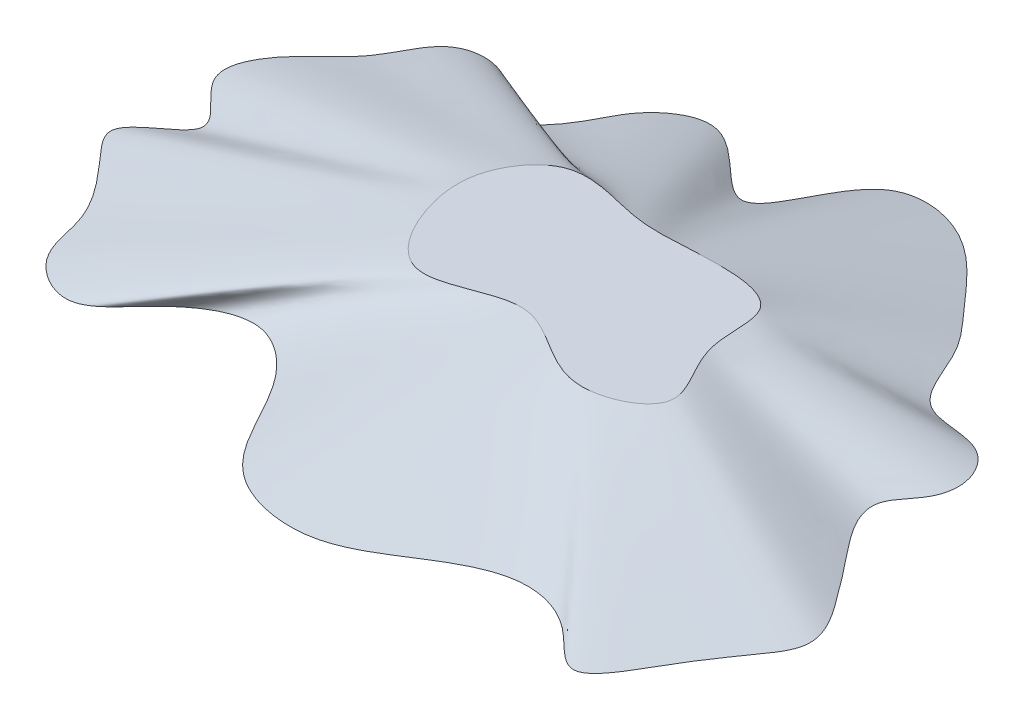
ISO-10303-21;
HEADER;
FILE_DESCRIPTION(('STEP AP214'),'2;1');
FILE_NAME('part.step','',(''),(''),'','','');
FILE_SCHEMA(('AUTOMOTIVE_DESIGN { 1 0 10303 214 1 1 1 1 }'));
ENDSEC;
DATA;
#1=APPLICATION_CONTEXT('core data for automotive mechanical design processes');
#2=APPLICATION_PROTOCOL_DEFINITION('international standard','automotive_design',2000,#1);
#3=PRODUCT_CONTEXT('',#1,'mechanical');
#4=PRODUCT('Part','Part','',(#3));
#5=PRODUCT_RELATED_PRODUCT_CATEGORY('part','',(#4));
#6=PRODUCT_DEFINITION_FORMATION('','',#4);
#7=PRODUCT_DEFINITION_CONTEXT('part definition',#1,'design');
#8=PRODUCT_DEFINITION('design','',#6,#7);
#9=PRODUCT_DEFINITION_SHAPE('','',#8);
#10=(LENGTH_UNIT() NAMED_UNIT(*) SI_UNIT(.MILLI.,.METRE.));
#11=(NAMED_UNIT(*) PLANE_ANGLE_UNIT() SI_UNIT($,.RADIAN.));
#12=(NAMED_UNIT(*) SI_UNIT($,.STERADIAN.) SOLID_ANGLE_UNIT());
#13=UNCERTAINTY_MEASURE_WITH_UNIT(LENGTH_MEASURE(1.E-05),#10,'distance_accuracy_value','');
#14=(GEOMETRIC_REPRESENTATION_CONTEXT(3) GLOBAL_UNCERTAINTY_ASSIGNED_CONTEXT((#13)) GLOBAL_UNIT_ASSIGNED_CONTEXT((#10,
#11,#12)) REPRESENTATION_CONTEXT('',''));
#15=CARTESIAN_POINT('',(0.,0.,0.));
#16=DIRECTION('',(0.,0.,1.));
#17=DIRECTION('',(1.,0.,0.));
#18=AXIS2_PLACEMENT_3D('',#15,#16,#17);
#19=CARTESIAN_POINT('',(34.9083848394784,12.7,4.71063547577298));
#20=DIRECTION('',(0.,1.,0.));
#21=DIRECTION('',(0.,0.,1.));
#22=AXIS2_PLACEMENT_3D('',#19,#20,#21);
#23=PLANE('',#22);
#24=CARTESIAN_POINT('',(-29.5756730277102,12.7,3.52827025257535));
#25=CARTESIAN_POINT('',(-27.8814864728783,12.7,10.6717173190112));
#26=CARTESIAN_POINT('',(-19.0901605450378,12.7,26.9384464948508));
#27=CARTESIAN_POINT('',(5.50930371801553,12.7,8.15901188641278));
#28=CARTESIAN_POINT('',(20.7413398009985,12.7,29.8795978044202));
#29=CARTESIAN_POINT('',(45.5831379688821,12.7,17.9785133429483));
#30=CARTESIAN_POINT('',(30.8297716786299,12.7,3.11660304964641));
#31=CARTESIAN_POINT('',(35.1676287758205,12.7,-16.5945431904634));
#32=CARTESIAN_POINT('',(13.2930390906351,12.7,-17.2081131785827));
#33=CARTESIAN_POINT('',(-2.47161777381469,12.7,-15.1697993395968));
#34=CARTESIAN_POINT('',(-20.2384691081271,12.7,-22.6843139276812));
#35=CARTESIAN_POINT('',(-30.712637420945,12.7,-8.98673720286616));
#36=CARTESIAN_POINT('',(-30.6206439788035,12.7,-0.877793916572667));
#37=CARTESIAN_POINT('',(-29.5756730277102,12.7,3.52827025257535));
#38=B_SPLINE_CURVE_WITH_KNOTS('',3,(#24,#25,#26,#27,#28,#29,#30,#31,#32,#33,#34,#35,#36,#37),
.UNSPECIFIED.,.T.,.F.,(4,1,1,1,1,1,1,1,1,1,1,4),(0.,0.106147136055088,0.216054178461619,
0.347828588984127,0.426500589345041,0.514470445120685,0.592300723714563,0.684574484635472,
0.770463698091376,0.869982034654855,0.934528654236482,1.),.UNSPECIFIED.);
#39=CARTESIAN_POINT('',(-29.5756730277102,12.7,3.52827025257535));
#40=VERTEX_POINT('',#39);
#41=EDGE_CURVE('E55',#40,#40,#38,.T.);
#42=ORIENTED_EDGE('',*,*,#41,.T.);
#43=EDGE_LOOP('',(#42));
#44=FACE_BOUND('',#43,.T.);
#45=ADVANCED_FACE('F45',(#44),#23,.T.);
#46=CARTESIAN_POINT('',(73.5532406350785,0.,5.61808507576661));
#47=DIRECTION('',(0.,1.,0.));
#48=DIRECTION('',(0.,0.,1.));
#49=AXIS2_PLACEMENT_3D('',#46,#47,#48);
#50=PLANE('',#49);
#51=CARTESIAN_POINT('',(-95.2284648689735,0.,15.2013776373955));
#52=CARTESIAN_POINT('',(-95.2999292131674,0.,17.140655024939));
#53=CARTESIAN_POINT('',(-88.1114495701708,0.,25.351341490162));
#54=CARTESIAN_POINT('',(-79.9806306202945,0.,34.4559803815624));
#55=CARTESIAN_POINT('',(-78.5772801666937,0.,49.9621990224749));
#56=CARTESIAN_POINT('',(-63.932190207539,0.,58.8519478013123));
#57=CARTESIAN_POINT('',(-53.6062240830265,0.,44.3096662119803));
#58=CARTESIAN_POINT('',(-39.4292443910359,0.,34.8010942162573));
#59=CARTESIAN_POINT('',(-19.9603510233611,0.,47.4882191715443));
#60=CARTESIAN_POINT('',(-15.4584015850629,0.,72.3025830851409));
#61=CARTESIAN_POINT('',(12.7202670566613,0.,77.7518749276973));
#62=CARTESIAN_POINT('',(28.8247185416495,0.,67.1435866749527));
#63=CARTESIAN_POINT('',(44.6671187849523,0.,57.3981227184752));
#64=CARTESIAN_POINT('',(60.6026243534746,0.,61.3259804845011));
#65=CARTESIAN_POINT('',(70.9518830490098,0.,75.2011435785986));
#66=CARTESIAN_POINT('',(78.8518561387934,0.,63.3871054523166));
#67=CARTESIAN_POINT('',(83.3757118431352,0.,54.9365343862368));
#68=CARTESIAN_POINT('',(89.2013718906085,0.,46.8808231523344));
#69=CARTESIAN_POINT('',(95.9252003762561,0.,37.123302953244));
#70=CARTESIAN_POINT('',(87.8909866986869,0.,25.3215617032036));
#71=CARTESIAN_POINT('',(79.9617244020685,0.,15.2216194290523));
#72=CARTESIAN_POINT('',(69.1856356253337,0.,1.85083623637777));
#73=CARTESIAN_POINT('',(78.3048921111515,0.,-6.21852794537924));
#74=CARTESIAN_POINT('',(79.8571996099118,0.,-14.7231176542555));
#75=CARTESIAN_POINT('',(73.5811822429659,0.,-24.9196258588382));
#76=CARTESIAN_POINT('',(56.5276304884445,0.,-21.8915130727115));
#77=CARTESIAN_POINT('',(52.6041220557884,0.,-39.3745976726916));
#78=CARTESIAN_POINT('',(40.3187225768359,0.,-52.2197178312823));
#79=CARTESIAN_POINT('',(29.0701179535843,0.,-66.7128898911529));
#80=CARTESIAN_POINT('',(3.96459095788384,0.,-68.5496640165683));
#81=CARTESIAN_POINT('',(-3.07255429867468,0.,-33.026131759314));
#82=CARTESIAN_POINT('',(-21.2896083413009,0.,-63.4514265533331));
#83=CARTESIAN_POINT('',(-37.2022843766891,0.,-51.9408378208401));
#84=CARTESIAN_POINT('',(-40.7331558658021,0.,-42.1777722488928));
#85=CARTESIAN_POINT('',(-50.6258679729517,0.,-30.2542898370378));
#86=CARTESIAN_POINT('',(-58.3453073919591,0.,-45.2313873466331));
#87=CARTESIAN_POINT('',(-74.0783248517851,0.,-44.6344404860311));
#88=CARTESIAN_POINT('',(-79.00242846214,0.,-29.1717805608579));
#89=CARTESIAN_POINT('',(-90.6339799739566,0.,-22.051772230378));
#90=CARTESIAN_POINT('',(-97.6884917412061,0.,-6.54196325179716));
#91=CARTESIAN_POINT('',(-76.6790199345395,0.,4.08239423804333));
#92=CARTESIAN_POINT('',(-95.0736064689189,0.,10.9990947103683));
#93=CARTESIAN_POINT('',(-95.2284648689735,0.,15.2013776373955));
#94=B_SPLINE_CURVE_WITH_KNOTS('',3,(#51,#52,#53,#54,#55,#56,#57,#58,#59,#60,#61,#62,#63,#64,#65,
#66,#67,#68,#69,#70,#71,#72,#73,#74,#75,#76,#77,#78,#79,#80,#81,#82,#83,#84,#85,#86,#87,#88,#89,
#90,#91,#92,#93),.UNSPECIFIED.,.T.,.F.,(4,1,1,1,1,1,1,1,1,1,1,1,1,1,1,1,1,1,1,1,1,1,1,1,1,1,1,1,
1,1,1,1,1,1,1,1,1,1,1,1,4),(0.,0.0119231063799372,0.0465572653297819,0.0655553056181603,
0.0882298451152997,0.112693562398542,0.145128486102264,0.163385092650192,0.220901848117804,
0.257258383958837,0.287774358610111,0.318884962902541,0.347533475958289,0.367888519124409,
0.384580206138698,0.403052400023825,0.421263560654512,0.43565674970862,0.458928458882621,
0.482188295744393,0.510618234724564,0.524722254432494,0.536927739099029,0.55275879313431,
0.577529207122736,0.606822873222294,0.626996171293105,0.670842276135462,0.695764623177421,
0.737654051371631,0.775272657919951,0.798698159610183,0.816582819180089,0.834508616606692,
0.85716690777534,0.876906519246642,0.900601670257543,0.929756712078599,0.947972927854597,
0.974163434947794,1.),.UNSPECIFIED.);
#95=CARTESIAN_POINT('',(-95.2284648689735,0.,15.2013776373955));
#96=VERTEX_POINT('',#95);
#97=EDGE_CURVE('E11',#96,#96,#94,.T.);
#98=ORIENTED_EDGE('',*,*,#97,.F.);
#99=EDGE_LOOP('',(#98));
#100=FACE_BOUND('',#99,.T.);
#101=ADVANCED_FACE('F102',(#100),#50,.F.);
#102=CARTESIAN_POINT('',(-95.2284648689736,0.,15.2013776373955));
#103=CARTESIAN_POINT('',(-29.5756730277102,12.7,3.52827025257534));
#104=CARTESIAN_POINT('',(-95.2999292131675,0.,17.140655024939));
#105=CARTESIAN_POINT('',(-29.3853714588555,12.7,4.33066664740941));
#106=CARTESIAN_POINT('',(-88.1114495701708,0.,25.351341490162));
#107=CARTESIAN_POINT('',(-28.5129570160902,12.7,7.5056560079508));
#108=CARTESIAN_POINT('',(-79.9806306202945,0.,34.4559803815624));
#109=CARTESIAN_POINT('',(-26.6057053369926,12.7,11.975080553669));
#110=CARTESIAN_POINT('',(-78.5772801666937,0.,49.9621990224749));
#111=CARTESIAN_POINT('',(-23.600881533361,12.7,16.2764230636256));
#112=CARTESIAN_POINT('',(-65.3818178244463,0.,57.972006102551));
#113=CARTESIAN_POINT('',(-20.81991592188,12.7,18.7892704347481));
#114=CARTESIAN_POINT('',(-58.6647136095989,0.,51.4336464986749));
#115=CARTESIAN_POINT('',(-18.3237212544386,12.7,19.8496867670633));
#116=CARTESIAN_POINT('',(-50.2263793200784,0.,42.0427872320368));
#117=CARTESIAN_POINT('',(-15.117179780628,12.7,20.2967677545488));
#118=CARTESIAN_POINT('',(-39.4292443910359,0.,34.8010942162573));
#119=CARTESIAN_POINT('',(-11.6125841418971,12.7,19.5579171634531));
#120=CARTESIAN_POINT('',(-20.8325463731965,0.,46.9198431894171));
#121=CARTESIAN_POINT('',(-4.99216434644447,12.7,17.1369764265642));
#122=CARTESIAN_POINT('',(-17.1127261973175,0.,63.1840859713165));
#123=CARTESIAN_POINT('',(-0.0491436526245878,12.7,15.2315707923849));
#124=CARTESIAN_POINT('',(-3.52694829373998,0.,74.6099302461056));
#125=CARTESIAN_POINT('',(5.55686358530825,12.7,15.5919273126751));
#126=CARTESIAN_POINT('',(12.7202670566613,0.,77.7518749276973));
#127=CARTESIAN_POINT('',(9.58539989750889,12.7,17.2460544559311));
#128=CARTESIAN_POINT('',(28.8247185416495,0.,67.1435866749527));
#129=CARTESIAN_POINT('',(15.0048211724672,12.7,20.7270310121599));
#130=CARTESIAN_POINT('',(44.6671187849523,0.,57.3981227184752));
#131=CARTESIAN_POINT('',(20.268413494565,12.7,23.6625050943743));
#132=CARTESIAN_POINT('',(56.6125041749379,0.,60.3424770453883));
#133=CARTESIAN_POINT('',(24.1694073042659,12.7,24.57952755404));
#134=CARTESIAN_POINT('',(65.1622402274639,0.,67.4390186990479));
#135=CARTESIAN_POINT('',(27.5923216675784,12.7,24.6052864188884));
#136=CARTESIAN_POINT('',(70.9938756668749,0.,75.1383455939926));
#137=CARTESIAN_POINT('',(30.3079631645982,12.7,24.2389029893652));
#138=CARTESIAN_POINT('',(78.8518561387934,0.,63.3871054523166));
#139=CARTESIAN_POINT('',(34.1666063306382,12.7,22.8541107648814));
#140=CARTESIAN_POINT('',(83.3757118431352,0.,54.9365343862368));
#141=CARTESIAN_POINT('',(37.3102036395799,12.7,20.8939210196097));
#142=CARTESIAN_POINT('',(88.1570436355976,0.,48.3249182054643));
#143=CARTESIAN_POINT('',(38.9267652190391,12.7,18.9844234051192));
#144=CARTESIAN_POINT('',(92.0230025946149,0.,42.786114513129));
#145=CARTESIAN_POINT('',(39.5777898520955,12.7,17.3836871045497));
#146=CARTESIAN_POINT('',(95.2345874835911,0.,36.1088371958882));
#147=CARTESIAN_POINT('',(39.8627239500113,12.7,15.4664716048353));
#148=CARTESIAN_POINT('',(87.8909866986869,0.,25.3215617032036));
#149=CARTESIAN_POINT('',(38.9773617328739,12.7,12.4111727360836));
#150=CARTESIAN_POINT('',(79.9617244020685,0.,15.2216194290523));
#151=CARTESIAN_POINT('',(36.4862431488415,12.7,7.90119636665085));
#152=CARTESIAN_POINT('',(70.8647363116966,0.,3.93423511153363));
#153=CARTESIAN_POINT('',(34.5783862666323,12.7,4.25652323142171));
#154=CARTESIAN_POINT('',(74.5636442793247,0.,-2.90800681943336));
#155=CARTESIAN_POINT('',(33.6765379079749,12.7,1.33446853933737));
#156=CARTESIAN_POINT('',(78.4467937686131,0.,-6.99596113866357));
#157=CARTESIAN_POINT('',(33.2913772806231,12.7,-0.507859420364786));
#158=CARTESIAN_POINT('',(79.8571996099118,0.,-14.7231176542555));
#159=CARTESIAN_POINT('',(33.0101977346614,12.7,-3.20993316291858));
#160=CARTESIAN_POINT('',(73.5811822429659,0.,-24.9196258588382));
#161=CARTESIAN_POINT('',(32.8557652078619,12.7,-6.84983462375573));
#162=CARTESIAN_POINT('',(60.0708560838091,0.,-22.5206656905297));
#163=CARTESIAN_POINT('',(32.5604901643822,12.7,-10.2929623528028));
#164=CARTESIAN_POINT('',(54.4378059024621,0.,-31.2037346883828));
#165=CARTESIAN_POINT('',(31.4197736797052,12.7,-12.9395398771232));
#166=CARTESIAN_POINT('',(50.6593357127756,0.,-41.4079881457962));
#167=CARTESIAN_POINT('',(29.5049421524677,12.7,-14.7308523514768));
#168=CARTESIAN_POINT('',(40.3187225768359,0.,-52.2197178312823));
#169=CARTESIAN_POINT('',(25.1533397868337,12.7,-16.5529423958884));
#170=CARTESIAN_POINT('',(30.485352578508,0.,-64.8894424849113));
#171=CARTESIAN_POINT('',(19.2795807627873,12.7,-16.9035635127564));
#172=CARTESIAN_POINT('',(16.0070274718411,0.,-67.6686135690082));
#173=CARTESIAN_POINT('',(14.2727080492964,12.7,-16.773193616555));
#174=CARTESIAN_POINT('',(3.03923241512433,0.,-63.8784510680211));
#175=CARTESIAN_POINT('',(9.67631453120167,12.7,-16.5555286128443));
#176=CARTESIAN_POINT('',(-2.74849775240565,0.,-34.661970264116));
#177=CARTESIAN_POINT('',(4.35984151536564,12.7,-16.1788359674123));
#178=CARTESIAN_POINT('',(-16.2927071448814,0.,-55.1058295318878));
#179=CARTESIAN_POINT('',(-0.479704944221434,12.7,-16.4466009479054));
#180=CARTESIAN_POINT('',(-27.9042976818697,0.,-58.6666267859547));
#181=CARTESIAN_POINT('',(-4.37259061213453,12.7,-17.1154573340688));
#182=CARTESIAN_POINT('',(-37.2022843766891,0.,-51.9408378208401));
#183=CARTESIAN_POINT('',(-7.39955596023602,12.7,-17.8363656001907));
#184=CARTESIAN_POINT('',(-40.7331558658021,0.,-42.1777722488928));
#185=CARTESIAN_POINT('',(-11.3150027235566,12.7,-18.7361804278957));
#186=CARTESIAN_POINT('',(-50.6258679729517,0.,-30.2542898370378));
#187=CARTESIAN_POINT('',(-15.1159289396738,12.7,-19.3202600556815));
#188=CARTESIAN_POINT('',(-57.4592022748131,0.,-43.5121844326794));
#189=CARTESIAN_POINT('',(-18.4305772536401,12.7,-19.246694472815));
#190=CARTESIAN_POINT('',(-66.7895216426689,0.,-44.9109944404354));
#191=CARTESIAN_POINT('',(-20.8740386564565,12.7,-18.5106474094124));
#192=CARTESIAN_POINT('',(-74.9476344351385,0.,-41.9046363387704));
#193=CARTESIAN_POINT('',(-23.244264562409,12.7,-17.2876361793851));
#194=CARTESIAN_POINT('',(-79.00242846214,0.,-29.1717805608579));
#195=CARTESIAN_POINT('',(-26.1827322378143,12.7,-14.7067587380055));
#196=CARTESIAN_POINT('',(-88.4335344443291,0.,-23.3987284370198));
#197=CARTESIAN_POINT('',(-28.2522110111224,12.7,-11.3133703341307));
#198=CARTESIAN_POINT('',(-93.887549388917,0.,-14.8985854770639));
#199=CARTESIAN_POINT('',(-29.4046449661615,12.7,-8.42784403533092));
#200=CARTESIAN_POINT('',(-96.2612239239411,0.,-5.82020291132273));
#201=CARTESIAN_POINT('',(-30.1966524097041,12.7,-5.70614243685617));
#202=CARTESIAN_POINT('',(-76.6790199345395,0.,4.08239423804333));
#203=CARTESIAN_POINT('',(-30.5052687653891,12.7,-1.61055244207797));
#204=CARTESIAN_POINT('',(-95.0736064689189,0.,10.9990947103683));
#205=CARTESIAN_POINT('',(-29.9880436555129,12.7,1.78953153867193));
#206=CARTESIAN_POINT('',(-95.2284648689736,0.,15.2013776373955));
#207=CARTESIAN_POINT('',(-29.5756730277102,12.7,3.52827025257534));
#208=B_SPLINE_SURFACE_WITH_KNOTS('',3,1,((#102,#103),(#104,#105),(#106,#107),(#108,#109),(#110,
#111),(#112,#113),(#114,#115),(#116,#117),(#118,#119),(#120,#121),(#122,#123),(#124,#125),(#126,
#127),(#128,#129),(#130,#131),(#132,#133),(#134,#135),(#136,#137),(#138,#139),(#140,#141),(#142,
#143),(#144,#145),(#146,#147),(#148,#149),(#150,#151),(#152,#153),(#154,#155),(#156,#157),(#158,
#159),(#160,#161),(#162,#163),(#164,#165),(#166,#167),(#168,#169),(#170,#171),(#172,#173),(#174,
#175),(#176,#177),(#178,#179),(#180,#181),(#182,#183),(#184,#185),(#186,#187),(#188,#189),(#190,
#191),(#192,#193),(#194,#195),(#196,#197),(#198,#199),(#200,#201),(#202,#203),(#204,#205),(#206,
#207)),.UNSPECIFIED.,.T.,.F.,.F.,(4,1,1,1,1,1,1,1,1,1,1,1,1,1,1,1,1,1,1,1,1,1,1,1,1,1,1,1,1,1,1,
1,1,1,1,1,1,1,1,1,1,1,1,1,1,1,1,1,1,1,4),(2,2),(0.,0.0119231063799372,0.0465572653297819,
0.0655553056181603,0.0882298451152998,0.106147136055088,0.112693562398542,0.145128486102264,
0.163385092650192,0.216054178461619,0.220901848117804,0.257258383958837,0.287774358610111,
0.318884962902541,0.347533475958289,0.347828588984127,0.367888519124409,0.384580206138698,
0.403052400023825,0.421263560654512,0.426500589345041,0.43565674970862,0.458928458882622,
0.482188295744393,0.510618234724564,0.514470445120685,0.524722254432494,0.536927739099029,
0.55275879313431,0.577529207122737,0.592300723714563,0.606822873222294,0.626996171293105,
0.670842276135462,0.684574484635472,0.695764623177421,0.737654051371631,0.770463698091376,
0.775272657919951,0.798698159610184,0.816582819180089,0.834508616606692,0.85716690777534,
0.869982034654855,0.876906519246642,0.900601670257544,0.929756712078599,0.934528654236482,
0.947972927854597,0.974163434947795,1.),(0.,1.),.UNSPECIFIED.);
#209=ORIENTED_EDGE('',*,*,#97,.T.);
#210=EDGE_LOOP('',(#209));
#211=FACE_BOUND('',#210,.T.);
#212=ORIENTED_EDGE('',*,*,#41,.F.);
#213=EDGE_LOOP('',(#212));
#214=FACE_BOUND('',#213,.T.);
#215=ADVANCED_FACE('F86',(#211,#214),#208,.T.);
#216=CLOSED_SHELL('',(#45,#101,#215));
#217=MANIFOLD_SOLID_BREP('B2',#216);
#218=ADVANCED_BREP_SHAPE_REPRESENTATION('',(#18,#217),#14);
#219=SHAPE_DEFINITION_REPRESENTATION(#9,#218);
ENDSEC;
END-ISO-10303-21;
